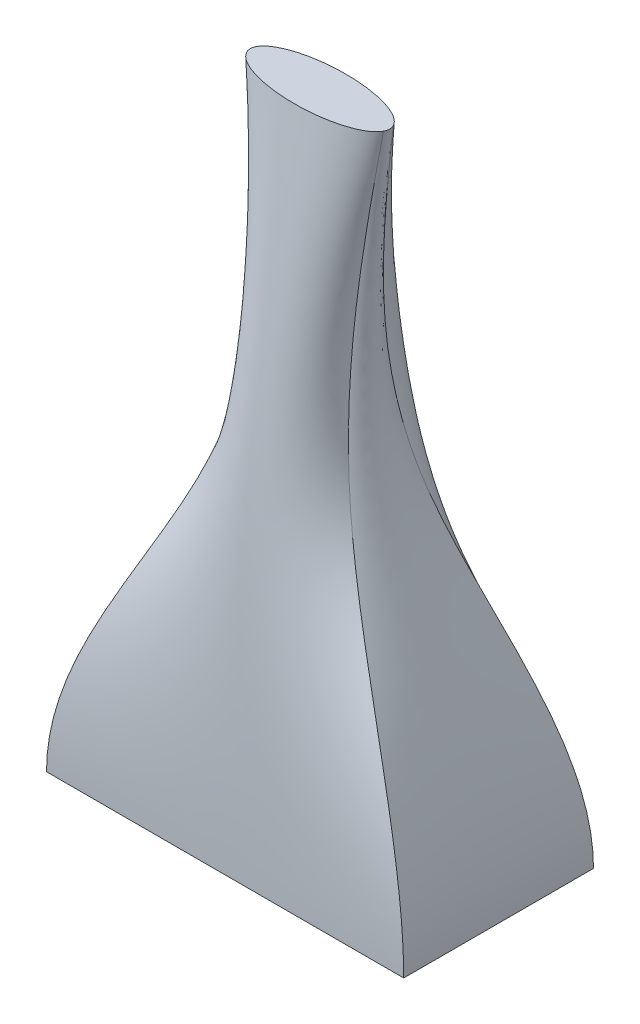
ISO-10303-21;
HEADER;
FILE_DESCRIPTION(('STEP AP214'),'2;1');
FILE_NAME('part.step','',(''),(''),'','','');
FILE_SCHEMA(('AUTOMOTIVE_DESIGN { 1 0 10303 214 1 1 1 1 }'));
ENDSEC;
DATA;
#1=APPLICATION_CONTEXT('core data for automotive mechanical design processes');
#2=APPLICATION_PROTOCOL_DEFINITION('international standard','automotive_design',2000,#1);
#3=PRODUCT_CONTEXT('',#1,'mechanical');
#4=PRODUCT('Part','Part','',(#3));
#5=PRODUCT_RELATED_PRODUCT_CATEGORY('part','',(#4));
#6=PRODUCT_DEFINITION_FORMATION('','',#4);
#7=PRODUCT_DEFINITION_CONTEXT('part definition',#1,'design');
#8=PRODUCT_DEFINITION('design','',#6,#7);
#9=PRODUCT_DEFINITION_SHAPE('','',#8);
#10=(LENGTH_UNIT() NAMED_UNIT(*) SI_UNIT(.MILLI.,.METRE.));
#11=(NAMED_UNIT(*) PLANE_ANGLE_UNIT() SI_UNIT($,.RADIAN.));
#12=(NAMED_UNIT(*) SI_UNIT($,.STERADIAN.) SOLID_ANGLE_UNIT());
#13=UNCERTAINTY_MEASURE_WITH_UNIT(LENGTH_MEASURE(1.E-05),#10,'distance_accuracy_value','');
#14=(GEOMETRIC_REPRESENTATION_CONTEXT(3) GLOBAL_UNCERTAINTY_ASSIGNED_CONTEXT((#13)) GLOBAL_UNIT_ASSIGNED_CONTEXT((#10,
#11,#12)) REPRESENTATION_CONTEXT('',''));
#15=CARTESIAN_POINT('',(0.,0.,0.));
#16=DIRECTION('',(0.,0.,1.));
#17=DIRECTION('',(1.,0.,0.));
#18=AXIS2_PLACEMENT_3D('',#15,#16,#17);
#19=CARTESIAN_POINT('',(0.,200.,0.));
#20=DIRECTION('',(0.,1.,0.));
#21=DIRECTION('',(0.,0.,1.));
#22=AXIS2_PLACEMENT_3D('',#19,#20,#21);
#23=PLANE('',#22);
#24=CARTESIAN_POINT('',(0.,200.,0.));
#25=DIRECTION('',(0.,1.,0.));
#26=DIRECTION('',(-1.,0.,0.));
#27=AXIS2_PLACEMENT_3D('',#24,#25,#26);
#28=ELLIPSE('',#27,22.0055954578697,8.13324408878202);
#29=CARTESIAN_POINT('',(-21.593109175741,200.,-1.56737252444683));
#30=VERTEX_POINT('',#29);
#31=CARTESIAN_POINT('',(-21.593109175741,200.,1.56737252444684));
#32=VERTEX_POINT('',#31);
#33=EDGE_CURVE('E12',#30,#32,#28,.T.);
#34=ORIENTED_EDGE('',*,*,#33,.T.);
#35=CARTESIAN_POINT('',(21.593109175741,200.,1.56737252444684));
#36=VERTEX_POINT('',#35);
#37=EDGE_CURVE('E127',#32,#36,#28,.T.);
#38=ORIENTED_EDGE('',*,*,#37,.T.);
#39=CARTESIAN_POINT('',(21.593109175741,200.,-1.56737252444683));
#40=VERTEX_POINT('',#39);
#41=EDGE_CURVE('E166',#36,#40,#28,.T.);
#42=ORIENTED_EDGE('',*,*,#41,.T.);
#43=EDGE_CURVE('E232',#40,#30,#28,.T.);
#44=ORIENTED_EDGE('',*,*,#43,.T.);
#45=EDGE_LOOP('',(#34,#38,#42,#44));
#46=FACE_BOUND('',#45,.T.);
#47=ADVANCED_FACE('F117',(#46),#23,.T.);
#48=CARTESIAN_POINT('',(0.,0.,0.));
#49=DIRECTION('',(0.,1.,0.));
#50=DIRECTION('',(0.,0.,1.));
#51=AXIS2_PLACEMENT_3D('',#48,#49,#50);
#52=PLANE('',#51);
#53=DIRECTION('',(0.,0.,1.));
#54=VECTOR('',#53,1.);
#55=CARTESIAN_POINT('',(-56.4085508401865,0.,29.9737188046887));
#56=LINE('',#55,#54);
#57=CARTESIAN_POINT('',(-56.4085508401865,0.,-29.9737188046887));
#58=VERTEX_POINT('',#57);
#59=CARTESIAN_POINT('',(-56.4085508401865,0.,29.9737188046887));
#60=VERTEX_POINT('',#59);
#61=EDGE_CURVE('E227',#58,#60,#56,.T.);
#62=ORIENTED_EDGE('',*,*,#61,.F.);
#63=DIRECTION('',(-1.,0.,0.));
#64=VECTOR('',#63,1.);
#65=CARTESIAN_POINT('',(56.4085508401865,0.,-29.9737188046887));
#66=LINE('',#65,#64);
#67=CARTESIAN_POINT('',(56.4085508401865,0.,-29.9737188046887));
#68=VERTEX_POINT('',#67);
#69=EDGE_CURVE('E186',#68,#58,#66,.T.);
#70=ORIENTED_EDGE('',*,*,#69,.F.);
#71=DIRECTION('',(0.,0.,-1.));
#72=VECTOR('',#71,1.);
#73=CARTESIAN_POINT('',(56.4085508401865,0.,29.9737188046887));
#74=LINE('',#73,#72);
#75=CARTESIAN_POINT('',(56.4085508401865,0.,29.9737188046887));
#76=VERTEX_POINT('',#75);
#77=EDGE_CURVE('E163',#76,#68,#74,.T.);
#78=ORIENTED_EDGE('',*,*,#77,.F.);
#79=DIRECTION('',(1.,0.,0.));
#80=VECTOR('',#79,1.);
#81=CARTESIAN_POINT('',(56.4085508401865,0.,29.9737188046887));
#82=LINE('',#81,#80);
#83=EDGE_CURVE('E173',#60,#76,#82,.T.);
#84=ORIENTED_EDGE('',*,*,#83,.F.);
#85=EDGE_LOOP('',(#62,#70,#78,#84));
#86=FACE_BOUND('',#85,.T.);
#87=ADVANCED_FACE('F185',(#86),#52,.F.);
#88=CARTESIAN_POINT('',(-56.4085508401865,0.,29.9737188046887));
#89=CARTESIAN_POINT('',(-56.4085508401865,35.9530476684652,29.9737188046887));
#90=CARTESIAN_POINT('',(-5.91714478228835,96.0532951587496,6.11926076405095));
#91=CARTESIAN_POINT('',(-16.4494198535865,165.892397919174,3.06096477472467));
#92=CARTESIAN_POINT('',(-21.593109175741,200.,1.56737252444684));
#93=CARTESIAN_POINT('',(-54.0581945551787,0.,29.9737188046887));
#94=CARTESIAN_POINT('',(-54.0581945551787,35.7091005270158,29.9737188046887));
#95=CARTESIAN_POINT('',(-6.0815299062032,96.1526490082924,7.61136863985379));
#96=CARTESIAN_POINT('',(-16.3331880007341,165.924998486653,3.87081423538962));
#97=CARTESIAN_POINT('',(-21.3398312870377,200.,2.04402471280941));
#98=CARTESIAN_POINT('',(-49.3574819851632,0.,29.9737188046887));
#99=CARTESIAN_POINT('',(-49.3574819851632,35.2212062441168,29.9737188046887));
#100=CARTESIAN_POINT('',(-6.26830507647675,96.3513567073782,10.4523573185648));
#101=CARTESIAN_POINT('',(-15.906717433579,165.990199621611,5.42124898897039));
#102=CARTESIAN_POINT('',(-20.6138674451517,200.,2.96418648173874));
#103=CARTESIAN_POINT('',(-42.3064131301399,0.,29.9737188046887));
#104=CARTESIAN_POINT('',(-42.3064131301399,34.6727846115212,29.9737188046887));
#105=CARTESIAN_POINT('',(-6.16573325409738,96.5747157516661,14.2516943092618));
#106=CARTESIAN_POINT('',(-14.7421679954578,166.063489500452,7.51513335496865));
#107=CARTESIAN_POINT('',(-18.9306757492582,200.000000000001,4.22517212493317));
#108=CARTESIAN_POINT('',(-35.2553442751165,0.,29.9737188046887));
#109=CARTESIAN_POINT('',(-35.2553442751165,34.2358435918486,29.9737188046887));
#110=CARTESIAN_POINT('',(-5.72652049443935,96.7526714025079,17.5564204639037));
#111=CARTESIAN_POINT('',(-13.113239634861,166.121881351701,9.35327469546858));
#112=CARTESIAN_POINT('',(-16.7207212199064,200.,5.34707157111591));
#113=CARTESIAN_POINT('',(-28.2042754200932,0.,29.9737188046887));
#114=CARTESIAN_POINT('',(-28.2042754200932,33.9083557327735,29.9737188046887));
#115=CARTESIAN_POINT('',(-4.99195429636506,96.8860493928559,20.3340709738051));
#116=CARTESIAN_POINT('',(-11.0740738891787,166.165646119696,10.9116977493446));
#117=CARTESIAN_POINT('',(-14.0444229727187,200.,6.3100556334748));
#118=CARTESIAN_POINT('',(-21.1532065650699,0.,29.9737188046887));
#119=CARTESIAN_POINT('',(-21.1532065650699,33.671261155164,29.9737188046887));
#120=CARTESIAN_POINT('',(-4.01179299973184,96.9826123566653,22.5521810302804));
#121=CARTESIAN_POINT('',(-8.6913203761586,166.197330925389,12.1664272554713));
#122=CARTESIAN_POINT('',(-10.9766798864177,200.,7.09429512519775));
#123=CARTESIAN_POINT('',(-14.1021377100466,0.,29.9737188046887));
#124=CARTESIAN_POINT('',(-14.1021377100466,33.51308658319,29.9737188046887));
#125=CARTESIAN_POINT('',(-2.82040457762642,97.0470330854022,24.1782858246443));
#126=CARTESIAN_POINT('',(-6.00751025470157,166.218469032507,13.0934879527232));
#127=CARTESIAN_POINT('',(-7.56400980762569,200.,7.67996085947256));
#128=CARTESIAN_POINT('',(-7.0510688550233,0.,29.9737188046887));
#129=CARTESIAN_POINT('',(-7.0510688550233,33.4230735216072,29.9737188046887));
#130=CARTESIAN_POINT('',(-1.48097245558499,97.0836932574551,25.1799205482109));
#131=CARTESIAN_POINT('',(-3.11125380716321,166.230498183046,13.6689045799747));
#132=CARTESIAN_POINT('',(-3.90744083451046,200.,8.04722364948721));
#133=CARTESIAN_POINT('',(0.,0.,29.9737188046887));
#134=CARTESIAN_POINT('',(0.,33.3944270949021,29.9737188046887));
#135=CARTESIAN_POINT('',(0.,97.0953602634791,25.5246203922949));
#136=CARTESIAN_POINT('',(0.,166.234326429449,13.8687018761004));
#137=CARTESIAN_POINT('',(0.,200.,8.17625430842942));
#138=CARTESIAN_POINT('',(7.05106885502333,0.,29.9737188046887));
#139=CARTESIAN_POINT('',(7.05106885502333,33.4230735216072,29.9737188046887));
#140=CARTESIAN_POINT('',(1.48097245558499,97.083693257455,25.1799205482109));
#141=CARTESIAN_POINT('',(3.1112538071632,166.230498183046,13.6689045799747));
#142=CARTESIAN_POINT('',(3.90744083451045,200.,8.04722364948721));
#143=CARTESIAN_POINT('',(14.1021377100466,0.,29.9737188046887));
#144=CARTESIAN_POINT('',(14.1021377100466,33.51308658319,29.9737188046887));
#145=CARTESIAN_POINT('',(2.82040457762638,97.0470330854023,24.1782858246442));
#146=CARTESIAN_POINT('',(6.00751025470156,166.218469032507,13.0934879527232));
#147=CARTESIAN_POINT('',(7.56400980762569,200.,7.67996085947257));
#148=CARTESIAN_POINT('',(21.15320656507,0.,29.9737188046887));
#149=CARTESIAN_POINT('',(21.15320656507,33.671261155164,29.9737188046887));
#150=CARTESIAN_POINT('',(4.01179299973186,96.9826123566653,22.5521810302805));
#151=CARTESIAN_POINT('',(8.69132037615861,166.197330925389,12.1664272554714));
#152=CARTESIAN_POINT('',(10.9766798864177,200.,7.09429512519775));
#153=CARTESIAN_POINT('',(28.2042754200933,0.,29.9737188046887));
#154=CARTESIAN_POINT('',(28.2042754200933,33.9083557327735,29.9737188046887));
#155=CARTESIAN_POINT('',(4.99195429636501,96.8860493928559,20.3340709738051));
#156=CARTESIAN_POINT('',(11.0740738891786,166.165646119695,10.9116977493446));
#157=CARTESIAN_POINT('',(14.0444229727187,200.,6.3100556334748));
#158=CARTESIAN_POINT('',(35.2553442751166,0.,29.9737188046887));
#159=CARTESIAN_POINT('',(35.2553442751166,34.2358435918487,29.9737188046887));
#160=CARTESIAN_POINT('',(5.72652049443937,96.7526714025079,17.5564204639037));
#161=CARTESIAN_POINT('',(13.113239634861,166.121881351702,9.35327469546859));
#162=CARTESIAN_POINT('',(16.7207212199065,200.000000000001,5.34707157111592));
#163=CARTESIAN_POINT('',(42.3064131301399,0.,29.9737188046887));
#164=CARTESIAN_POINT('',(42.3064131301399,34.6727846115211,29.9737188046887));
#165=CARTESIAN_POINT('',(6.16573325409732,96.5747157516659,14.2516943092618));
#166=CARTESIAN_POINT('',(14.7421679954578,166.063489500452,7.51513335496865));
#167=CARTESIAN_POINT('',(18.9306757492581,199.999999999999,4.22517212493317));
#168=CARTESIAN_POINT('',(49.3574819851632,0.,29.9737188046887));
#169=CARTESIAN_POINT('',(49.3574819851632,35.2212062441169,29.9737188046887));
#170=CARTESIAN_POINT('',(6.26830507647674,96.3513567073782,10.4523573185648));
#171=CARTESIAN_POINT('',(15.906717433579,165.990199621611,5.4212489889704));
#172=CARTESIAN_POINT('',(20.6138674451517,200.,2.96418648173875));
#173=CARTESIAN_POINT('',(54.0581945551787,0.,29.9737188046887));
#174=CARTESIAN_POINT('',(54.0581945551787,35.7091005270158,29.9737188046887));
#175=CARTESIAN_POINT('',(6.08152990620318,96.1526490082924,7.61136863985379));
#176=CARTESIAN_POINT('',(16.3331880007341,165.924998486653,3.87081423538962));
#177=CARTESIAN_POINT('',(21.3398312870377,200.,2.04402471280941));
#178=CARTESIAN_POINT('',(56.4085508401865,0.,29.9737188046887));
#179=CARTESIAN_POINT('',(56.4085508401865,35.9530476684652,29.9737188046887));
#180=CARTESIAN_POINT('',(5.91714478228833,96.0532951587496,6.11926076405095));
#181=CARTESIAN_POINT('',(16.4494198535865,165.892397919174,3.06096477472467));
#182=CARTESIAN_POINT('',(21.593109175741,200.,1.56737252444684));
#183=B_SPLINE_SURFACE_WITH_KNOTS('',3,3,((#88,#89,#90,#91,#92),(#93,#94,#95,#96,#97),(#98,#99,
#100,#101,#102),(#103,#104,#105,#106,#107),(#108,#109,#110,#111,#112),(#113,#114,#115,#116,
#117),(#118,#119,#120,#121,#122),(#123,#124,#125,#126,#127),(#128,#129,#130,#131,#132),(#133,
#134,#135,#136,#137),(#138,#139,#140,#141,#142),(#143,#144,#145,#146,#147),(#148,#149,#150,#151,
#152),(#153,#154,#155,#156,#157),(#158,#159,#160,#161,#162),(#163,#164,#165,#166,#167),(#168,
#169,#170,#171,#172),(#173,#174,#175,#176,#177),(#178,#179,#180,#181,#182)),.UNSPECIFIED.,.F.,
.F.,.F.,(4,1,1,1,1,1,1,1,1,1,1,1,1,1,1,1,4),(4,1,4),(0.,0.0625,0.125,0.1875,0.25,0.3125,0.375,
0.4375,0.5,0.5625,0.625,0.6875,0.75,0.8125,0.875,0.9375,1.),(0.,0.511625998434878,1.),.UNSPECIFIED.);
#184=CARTESIAN_POINT('',(56.4085508401865,0.,29.9737188046887));
#185=CARTESIAN_POINT('',(56.4085508401865,35.9530476684652,29.9737188046887));
#186=CARTESIAN_POINT('',(5.91714478228833,96.0532951587496,6.11926076405095));
#187=CARTESIAN_POINT('',(16.4494198535865,165.892397919174,3.06096477472467));
#188=CARTESIAN_POINT('',(21.593109175741,200.,1.56737252444684));
#189=B_SPLINE_CURVE_WITH_KNOTS('',3,(#184,#185,#186,#187,#188),.UNSPECIFIED.,.F.,.F.,(4,1,4),
(0.,0.511625998434878,1.),.UNSPECIFIED.);
#190=EDGE_CURVE('E158',#76,#36,#189,.T.);
#191=CARTESIAN_POINT('',(-56.4085508401865,0.,29.9737188046887));
#192=CARTESIAN_POINT('',(-56.4085508401865,35.9530476684652,29.9737188046887));
#193=CARTESIAN_POINT('',(-5.91714478228835,96.0532951587496,6.11926076405095));
#194=CARTESIAN_POINT('',(-16.4494198535865,165.892397919174,3.06096477472467));
#195=CARTESIAN_POINT('',(-21.593109175741,200.,1.56737252444684));
#196=B_SPLINE_CURVE_WITH_KNOTS('',3,(#191,#192,#193,#194,#195),.UNSPECIFIED.,.F.,.F.,(4,1,4),
(0.,0.511625998434878,1.),.UNSPECIFIED.);
#197=EDGE_CURVE('E170',#32,#60,#196,.F.);
#198=ORIENTED_EDGE('',*,*,#83,.T.);
#199=ORIENTED_EDGE('',*,*,#190,.T.);
#200=ORIENTED_EDGE('',*,*,#37,.F.);
#201=ORIENTED_EDGE('',*,*,#197,.T.);
#202=EDGE_LOOP('',(#198,#199,#200,#201));
#203=FACE_BOUND('',#202,.T.);
#204=ADVANCED_FACE('F175',(#203),#183,.T.);
#205=CARTESIAN_POINT('',(56.4085508401865,0.,29.9737188046887));
#206=CARTESIAN_POINT('',(56.4085508401865,35.9530476684652,29.9737188046887));
#207=CARTESIAN_POINT('',(5.91714478228833,96.0532951587496,6.11926076405095));
#208=CARTESIAN_POINT('',(16.4494198535865,165.892397919174,3.06096477472467));
#209=CARTESIAN_POINT('',(21.593109175741,200.,1.56737252444684));
#210=CARTESIAN_POINT('',(56.4085508401865,0.,9.9912396015629));
#211=CARTESIAN_POINT('',(56.4085508401865,35.9530476684652,9.9912396015629));
#212=CARTESIAN_POINT('',(11.9967879328767,96.0532951587496,2.81616252457295));
#213=CARTESIAN_POINT('',(18.8138254767558,165.892397919174,1.28172543591229));
#214=CARTESIAN_POINT('',(22.1430893808798,200.,0.532346254773147));
#215=CARTESIAN_POINT('',(56.4085508401865,0.,-9.99123960156288));
#216=CARTESIAN_POINT('',(56.4085508401865,35.9530476684652,-9.99123960156288));
#217=CARTESIAN_POINT('',(11.9967879328767,96.0532951587496,-2.81616252457296));
#218=CARTESIAN_POINT('',(18.8138254767558,165.892397919174,-1.28172543591229));
#219=CARTESIAN_POINT('',(22.1430893808798,200.,-0.532346254773141));
#220=CARTESIAN_POINT('',(56.4085508401865,0.,-29.9737188046887));
#221=CARTESIAN_POINT('',(56.4085508401865,35.9530476684652,-29.9737188046887));
#222=CARTESIAN_POINT('',(5.91714478228833,96.0532951587496,-6.11926076405096));
#223=CARTESIAN_POINT('',(16.4494198535865,165.892397919174,-3.06096477472467));
#224=CARTESIAN_POINT('',(21.593109175741,200.,-1.56737252444683));
#225=B_SPLINE_SURFACE_WITH_KNOTS('',3,3,((#205,#206,#207,#208,#209),(#210,#211,#212,#213,#214),
(#215,#216,#217,#218,#219),(#220,#221,#222,#223,#224)),.UNSPECIFIED.,.F.,.F.,.F.,(4,4),(4,1,4),
(0.,1.),(0.,0.511625998434878,1.),.UNSPECIFIED.);
#226=CARTESIAN_POINT('',(56.4085508401865,0.,-29.9737188046887));
#227=CARTESIAN_POINT('',(56.4085508401865,35.9530476684652,-29.9737188046887));
#228=CARTESIAN_POINT('',(5.91714478228833,96.0532951587496,-6.11926076405096));
#229=CARTESIAN_POINT('',(16.4494198535865,165.892397919174,-3.06096477472467));
#230=CARTESIAN_POINT('',(21.593109175741,200.,-1.56737252444683));
#231=B_SPLINE_CURVE_WITH_KNOTS('',3,(#226,#227,#228,#229,#230),.UNSPECIFIED.,.F.,.F.,(4,1,4),
(0.,0.511625998434878,1.),.UNSPECIFIED.);
#232=EDGE_CURVE('E169',#68,#40,#231,.T.);
#233=ORIENTED_EDGE('',*,*,#77,.T.);
#234=ORIENTED_EDGE('',*,*,#232,.T.);
#235=ORIENTED_EDGE('',*,*,#41,.F.);
#236=ORIENTED_EDGE('',*,*,#190,.F.);
#237=EDGE_LOOP('',(#233,#234,#235,#236));
#238=FACE_BOUND('',#237,.T.);
#239=ADVANCED_FACE('F160',(#238),#225,.T.);
#240=CARTESIAN_POINT('',(-56.4085508401865,0.,-29.9737188046887));
#241=CARTESIAN_POINT('',(-56.4085508401865,35.9530476684652,-29.9737188046887));
#242=CARTESIAN_POINT('',(-5.91714478228833,96.0532951587496,-6.11926076405096));
#243=CARTESIAN_POINT('',(-16.4494198535865,165.892397919174,-3.06096477472468));
#244=CARTESIAN_POINT('',(-21.593109175741,200.,-1.56737252444684));
#245=CARTESIAN_POINT('',(-56.4085508401865,0.,-9.99123960156288));
#246=CARTESIAN_POINT('',(-56.4085508401865,35.9530476684652,-9.99123960156288));
#247=CARTESIAN_POINT('',(-11.9967879328767,96.0532951587496,-2.81616252457296));
#248=CARTESIAN_POINT('',(-18.8138254767558,165.892397919174,-1.28172543591229));
#249=CARTESIAN_POINT('',(-22.1430893808798,200.,-0.532346254773143));
#250=CARTESIAN_POINT('',(-56.4085508401865,0.,9.9912396015629));
#251=CARTESIAN_POINT('',(-56.4085508401865,35.9530476684652,9.9912396015629));
#252=CARTESIAN_POINT('',(-11.9967879328767,96.0532951587496,2.81616252457294));
#253=CARTESIAN_POINT('',(-18.8138254767558,165.892397919174,1.28172543591229));
#254=CARTESIAN_POINT('',(-22.1430893808798,200.,0.532346254773146));
#255=CARTESIAN_POINT('',(-56.4085508401865,0.,29.9737188046887));
#256=CARTESIAN_POINT('',(-56.4085508401865,35.9530476684652,29.9737188046887));
#257=CARTESIAN_POINT('',(-5.91714478228834,96.0532951587496,6.11926076405095));
#258=CARTESIAN_POINT('',(-16.4494198535865,165.892397919174,3.06096477472467));
#259=CARTESIAN_POINT('',(-21.593109175741,200.,1.56737252444684));
#260=B_SPLINE_SURFACE_WITH_KNOTS('',3,3,((#240,#241,#242,#243,#244),(#245,#246,#247,#248,#249),
(#250,#251,#252,#253,#254),(#255,#256,#257,#258,#259)),.UNSPECIFIED.,.F.,.F.,.F.,(4,4),(4,1,4),
(0.,1.),(0.,0.511625998434878,1.),.UNSPECIFIED.);
#261=CARTESIAN_POINT('',(-56.4085508401865,0.,-29.9737188046887));
#262=CARTESIAN_POINT('',(-56.4085508401865,35.9530476684652,-29.9737188046887));
#263=CARTESIAN_POINT('',(-5.91714478228834,96.0532951587496,-6.11926076405096));
#264=CARTESIAN_POINT('',(-16.4494198535865,165.892397919174,-3.06096477472467));
#265=CARTESIAN_POINT('',(-21.593109175741,200.,-1.56737252444683));
#266=B_SPLINE_CURVE_WITH_KNOTS('',3,(#261,#262,#263,#264,#265),.UNSPECIFIED.,.F.,.F.,(4,1,4),
(0.,0.511625998434878,1.),.UNSPECIFIED.);
#267=EDGE_CURVE('E239',#58,#30,#266,.T.);
#268=ORIENTED_EDGE('',*,*,#61,.T.);
#269=ORIENTED_EDGE('',*,*,#197,.F.);
#270=ORIENTED_EDGE('',*,*,#33,.F.);
#271=ORIENTED_EDGE('',*,*,#267,.F.);
#272=EDGE_LOOP('',(#268,#269,#270,#271));
#273=FACE_BOUND('',#272,.T.);
#274=ADVANCED_FACE('F297',(#273),#260,.T.);
#275=CARTESIAN_POINT('',(56.4085508401865,0.,-29.9737188046887));
#276=CARTESIAN_POINT('',(56.4085508401865,35.9530476684652,-29.9737188046887));
#277=CARTESIAN_POINT('',(5.91714478228833,96.0532951587496,-6.11926076405095));
#278=CARTESIAN_POINT('',(16.4494198535865,165.892397919174,-3.06096477472467));
#279=CARTESIAN_POINT('',(21.593109175741,200.,-1.56737252444683));
#280=CARTESIAN_POINT('',(54.0581945551787,0.,-29.9737188046887));
#281=CARTESIAN_POINT('',(54.0581945551787,35.7091005270158,-29.9737188046887));
#282=CARTESIAN_POINT('',(6.08152990620319,96.1526490082924,-7.61136863985379));
#283=CARTESIAN_POINT('',(16.3331880007341,165.924998486653,-3.87081423538962));
#284=CARTESIAN_POINT('',(21.3398312870377,200.,-2.0440247128094));
#285=CARTESIAN_POINT('',(49.3574819851632,0.,-29.9737188046887));
#286=CARTESIAN_POINT('',(49.3574819851632,35.2212062441168,-29.9737188046887));
#287=CARTESIAN_POINT('',(6.26830507647674,96.3513567073782,-10.4523573185648));
#288=CARTESIAN_POINT('',(15.906717433579,165.990199621611,-5.42124898897039));
#289=CARTESIAN_POINT('',(20.6138674451517,200.,-2.96418648173874));
#290=CARTESIAN_POINT('',(42.3064131301399,0.,-29.9737188046887));
#291=CARTESIAN_POINT('',(42.3064131301399,34.6727846115212,-29.9737188046887));
#292=CARTESIAN_POINT('',(6.16573325409736,96.5747157516661,-14.2516943092618));
#293=CARTESIAN_POINT('',(14.7421679954578,166.063489500452,-7.51513335496866));
#294=CARTESIAN_POINT('',(18.9306757492582,200.000000000001,-4.22517212493317));
#295=CARTESIAN_POINT('',(35.2553442751166,0.,-29.9737188046887));
#296=CARTESIAN_POINT('',(35.2553442751166,34.2358435918486,-29.9737188046887));
#297=CARTESIAN_POINT('',(5.72652049443933,96.7526714025079,-17.5564204639037));
#298=CARTESIAN_POINT('',(13.113239634861,166.121881351701,-9.35327469546858));
#299=CARTESIAN_POINT('',(16.7207212199065,200.,-5.3470715711159));
#300=CARTESIAN_POINT('',(28.2042754200933,0.,-29.9737188046887));
#301=CARTESIAN_POINT('',(28.2042754200933,33.9083557327735,-29.9737188046887));
#302=CARTESIAN_POINT('',(4.99195429636505,96.8860493928559,-20.3340709738051));
#303=CARTESIAN_POINT('',(11.0740738891786,166.165646119696,-10.9116977493446));
#304=CARTESIAN_POINT('',(14.0444229727187,200.,-6.31005563347481));
#305=CARTESIAN_POINT('',(21.15320656507,0.,-29.9737188046887));
#306=CARTESIAN_POINT('',(21.15320656507,33.671261155164,-29.9737188046887));
#307=CARTESIAN_POINT('',(4.01179299973182,96.9826123566653,-22.5521810302804));
#308=CARTESIAN_POINT('',(8.69132037615861,166.197330925389,-12.1664272554713));
#309=CARTESIAN_POINT('',(10.9766798864177,200.,-7.09429512519775));
#310=CARTESIAN_POINT('',(14.1021377100466,0.,-29.9737188046887));
#311=CARTESIAN_POINT('',(14.1021377100466,33.51308658319,-29.9737188046887));
#312=CARTESIAN_POINT('',(2.8204045776264,97.0470330854022,-24.1782858246443));
#313=CARTESIAN_POINT('',(6.00751025470157,166.218469032507,-13.0934879527232));
#314=CARTESIAN_POINT('',(7.56400980762569,200.,-7.67996085947257));
#315=CARTESIAN_POINT('',(7.05106885502332,0.,-29.9737188046887));
#316=CARTESIAN_POINT('',(7.05106885502332,33.4230735216072,-29.9737188046887));
#317=CARTESIAN_POINT('',(1.48097245558498,97.0836932574551,-25.1799205482109));
#318=CARTESIAN_POINT('',(3.1112538071632,166.230498183046,-13.6689045799747));
#319=CARTESIAN_POINT('',(3.90744083451046,200.,-8.04722364948721));
#320=CARTESIAN_POINT('',(0.,0.,-29.9737188046887));
#321=CARTESIAN_POINT('',(0.,33.3944270949021,-29.9737188046887));
#322=CARTESIAN_POINT('',(0.,97.0953602634791,-25.5246203922949));
#323=CARTESIAN_POINT('',(0.,166.234326429449,-13.8687018761004));
#324=CARTESIAN_POINT('',(0.,200.,-8.17625430842942));
#325=CARTESIAN_POINT('',(-7.0510688550233,0.,-29.9737188046887));
#326=CARTESIAN_POINT('',(-7.0510688550233,33.4230735216072,-29.9737188046887));
#327=CARTESIAN_POINT('',(-1.480972455585,97.083693257455,-25.1799205482109));
#328=CARTESIAN_POINT('',(-3.1112538071632,166.230498183046,-13.6689045799747));
#329=CARTESIAN_POINT('',(-3.90744083451045,200.,-8.0472236494872));
#330=CARTESIAN_POINT('',(-14.1021377100466,0.,-29.9737188046887));
#331=CARTESIAN_POINT('',(-14.1021377100466,33.51308658319,-29.9737188046887));
#332=CARTESIAN_POINT('',(-2.82040457762639,97.0470330854023,-24.1782858246442));
#333=CARTESIAN_POINT('',(-6.00751025470157,166.218469032507,-13.0934879527232));
#334=CARTESIAN_POINT('',(-7.56400980762569,200.,-7.67996085947257));
#335=CARTESIAN_POINT('',(-21.1532065650699,0.,-29.9737188046887));
#336=CARTESIAN_POINT('',(-21.1532065650699,33.671261155164,-29.9737188046887));
#337=CARTESIAN_POINT('',(-4.01179299973186,96.9826123566653,-22.5521810302805));
#338=CARTESIAN_POINT('',(-8.69132037615861,166.197330925389,-12.1664272554714));
#339=CARTESIAN_POINT('',(-10.9766798864177,200.,-7.09429512519775));
#340=CARTESIAN_POINT('',(-28.2042754200932,0.,-29.9737188046887));
#341=CARTESIAN_POINT('',(-28.2042754200932,33.9083557327735,-29.9737188046887));
#342=CARTESIAN_POINT('',(-4.99195429636503,96.8860493928559,-20.3340709738051));
#343=CARTESIAN_POINT('',(-11.0740738891786,166.165646119695,-10.9116977493446));
#344=CARTESIAN_POINT('',(-14.0444229727187,200.,-6.3100556334748));
#345=CARTESIAN_POINT('',(-35.2553442751165,0.,-29.9737188046887));
#346=CARTESIAN_POINT('',(-35.2553442751165,34.2358435918487,-29.9737188046887));
#347=CARTESIAN_POINT('',(-5.72652049443934,96.7526714025079,-17.5564204639037));
#348=CARTESIAN_POINT('',(-13.113239634861,166.121881351702,-9.35327469546859));
#349=CARTESIAN_POINT('',(-16.7207212199064,200.000000000001,-5.34707157111592));
#350=CARTESIAN_POINT('',(-42.3064131301399,0.,-29.9737188046887));
#351=CARTESIAN_POINT('',(-42.3064131301399,34.6727846115211,-29.9737188046887));
#352=CARTESIAN_POINT('',(-6.16573325409735,96.5747157516659,-14.2516943092618));
#353=CARTESIAN_POINT('',(-14.7421679954578,166.063489500452,-7.51513335496865));
#354=CARTESIAN_POINT('',(-18.9306757492581,199.999999999999,-4.22517212493316));
#355=CARTESIAN_POINT('',(-49.3574819851632,0.,-29.9737188046887));
#356=CARTESIAN_POINT('',(-49.3574819851632,35.2212062441169,-29.9737188046887));
#357=CARTESIAN_POINT('',(-6.26830507647675,96.3513567073782,-10.4523573185648));
#358=CARTESIAN_POINT('',(-15.906717433579,165.990199621611,-5.4212489889704));
#359=CARTESIAN_POINT('',(-20.6138674451517,200.,-2.96418648173875));
#360=CARTESIAN_POINT('',(-54.0581945551787,0.,-29.9737188046887));
#361=CARTESIAN_POINT('',(-54.0581945551787,35.7091005270158,-29.9737188046887));
#362=CARTESIAN_POINT('',(-6.08152990620319,96.1526490082924,-7.61136863985379));
#363=CARTESIAN_POINT('',(-16.3331880007341,165.924998486653,-3.87081423538962));
#364=CARTESIAN_POINT('',(-21.3398312870377,200.,-2.04402471280941));
#365=CARTESIAN_POINT('',(-56.4085508401865,0.,-29.9737188046887));
#366=CARTESIAN_POINT('',(-56.4085508401865,35.9530476684652,-29.9737188046887));
#367=CARTESIAN_POINT('',(-5.91714478228834,96.0532951587496,-6.11926076405096));
#368=CARTESIAN_POINT('',(-16.4494198535865,165.892397919174,-3.06096477472467));
#369=CARTESIAN_POINT('',(-21.593109175741,200.,-1.56737252444683));
#370=B_SPLINE_SURFACE_WITH_KNOTS('',3,3,((#275,#276,#277,#278,#279),(#280,#281,#282,#283,#284),
(#285,#286,#287,#288,#289),(#290,#291,#292,#293,#294),(#295,#296,#297,#298,#299),(#300,#301,
#302,#303,#304),(#305,#306,#307,#308,#309),(#310,#311,#312,#313,#314),(#315,#316,#317,#318,
#319),(#320,#321,#322,#323,#324),(#325,#326,#327,#328,#329),(#330,#331,#332,#333,#334),(#335,
#336,#337,#338,#339),(#340,#341,#342,#343,#344),(#345,#346,#347,#348,#349),(#350,#351,#352,#353,
#354),(#355,#356,#357,#358,#359),(#360,#361,#362,#363,#364),(#365,#366,#367,#368,#369)),
.UNSPECIFIED.,.F.,.F.,.F.,(4,1,1,1,1,1,1,1,1,1,1,1,1,1,1,1,4),(4,1,4),(0.,0.0625,0.125,0.1875,
0.25,0.3125,0.375,0.4375,0.5,0.5625,0.625,0.6875,0.75,0.8125,0.875,0.9375,1.),(0.,
0.511625998434878,1.),.UNSPECIFIED.);
#371=ORIENTED_EDGE('',*,*,#69,.T.);
#372=ORIENTED_EDGE('',*,*,#267,.T.);
#373=ORIENTED_EDGE('',*,*,#43,.F.);
#374=ORIENTED_EDGE('',*,*,#232,.F.);
#375=EDGE_LOOP('',(#371,#372,#373,#374));
#376=FACE_BOUND('',#375,.T.);
#377=ADVANCED_FACE('F266',(#376),#370,.T.);
#378=CLOSED_SHELL('',(#47,#87,#204,#239,#274,#377));
#379=MANIFOLD_SOLID_BREP('B2',#378);
#380=ADVANCED_BREP_SHAPE_REPRESENTATION('',(#18,#379),#14);
#381=SHAPE_DEFINITION_REPRESENTATION(#9,#380);
ENDSEC;
END-ISO-10303-21;
